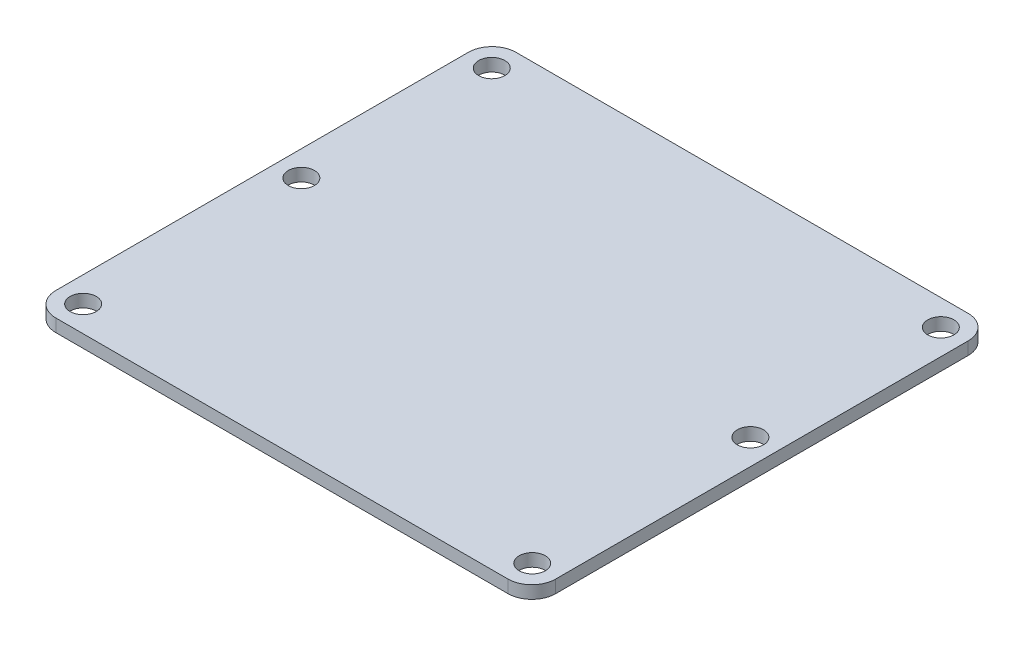
ISO-10303-21;
HEADER;
FILE_DESCRIPTION(('STEP AP214'),'2;1');
FILE_NAME('part.step','',(''),(''),'','','');
FILE_SCHEMA(('AUTOMOTIVE_DESIGN { 1 0 10303 214 1 1 1 1 }'));
ENDSEC;
DATA;
#1=APPLICATION_CONTEXT('core data for automotive mechanical design processes');
#2=APPLICATION_PROTOCOL_DEFINITION('international standard','automotive_design',2000,#1);
#3=PRODUCT_CONTEXT('',#1,'mechanical');
#4=PRODUCT('Part','Part','',(#3));
#5=PRODUCT_RELATED_PRODUCT_CATEGORY('part','',(#4));
#6=PRODUCT_DEFINITION_FORMATION('','',#4);
#7=PRODUCT_DEFINITION_CONTEXT('part definition',#1,'design');
#8=PRODUCT_DEFINITION('design','',#6,#7);
#9=PRODUCT_DEFINITION_SHAPE('','',#8);
#10=(LENGTH_UNIT() NAMED_UNIT(*) SI_UNIT(.MILLI.,.METRE.));
#11=(NAMED_UNIT(*) PLANE_ANGLE_UNIT() SI_UNIT($,.RADIAN.));
#12=(NAMED_UNIT(*) SI_UNIT($,.STERADIAN.) SOLID_ANGLE_UNIT());
#13=UNCERTAINTY_MEASURE_WITH_UNIT(LENGTH_MEASURE(1.E-05),#10,'distance_accuracy_value','');
#14=(GEOMETRIC_REPRESENTATION_CONTEXT(3) GLOBAL_UNCERTAINTY_ASSIGNED_CONTEXT((#13)) GLOBAL_UNIT_ASSIGNED_CONTEXT((#10,
#11,#12)) REPRESENTATION_CONTEXT('',''));
#15=CARTESIAN_POINT('',(0.,0.,0.));
#16=DIRECTION('',(0.,0.,1.));
#17=DIRECTION('',(1.,0.,0.));
#18=AXIS2_PLACEMENT_3D('',#15,#16,#17);
#19=CARTESIAN_POINT('',(31.5,1.6,-29.));
#20=DIRECTION('',(-1.,0.,0.));
#21=DIRECTION('',(0.,0.,1.));
#22=AXIS2_PLACEMENT_3D('',#19,#20,#21);
#23=PLANE('',#22);
#24=DIRECTION('',(0.,0.,-1.));
#25=VECTOR('',#24,1.);
#26=CARTESIAN_POINT('',(31.5,0.,-29.));
#27=LINE('',#26,#25);
#28=CARTESIAN_POINT('',(31.5,0.,26.));
#29=VERTEX_POINT('',#28);
#30=CARTESIAN_POINT('',(31.5,0.,-26.));
#31=VERTEX_POINT('',#30);
#32=EDGE_CURVE('E161',#29,#31,#27,.T.);
#33=ORIENTED_EDGE('',*,*,#32,.T.);
#34=DIRECTION('',(0.,-1.,0.));
#35=VECTOR('',#34,1.);
#36=CARTESIAN_POINT('',(31.5,1.6,-26.));
#37=LINE('',#36,#35);
#38=CARTESIAN_POINT('',(31.5,1.6,-26.));
#39=VERTEX_POINT('',#38);
#40=EDGE_CURVE('E11',#31,#39,#37,.F.);
#41=ORIENTED_EDGE('',*,*,#40,.T.);
#42=DIRECTION('',(0.,0.,-1.));
#43=VECTOR('',#42,1.);
#44=CARTESIAN_POINT('',(31.5,1.6,-29.));
#45=LINE('',#44,#43);
#46=CARTESIAN_POINT('',(31.5,1.6,26.));
#47=VERTEX_POINT('',#46);
#48=EDGE_CURVE('E129',#47,#39,#45,.T.);
#49=ORIENTED_EDGE('',*,*,#48,.F.);
#50=DIRECTION('',(0.,-1.,0.));
#51=VECTOR('',#50,1.);
#52=CARTESIAN_POINT('',(31.5,1.6,26.));
#53=LINE('',#52,#51);
#54=EDGE_CURVE('E45',#47,#29,#53,.T.);
#55=ORIENTED_EDGE('',*,*,#54,.T.);
#56=EDGE_LOOP('',(#33,#41,#49,#55));
#57=FACE_BOUND('',#56,.T.);
#58=ADVANCED_FACE('F37',(#57),#23,.F.);
#59=CARTESIAN_POINT('',(-31.5,1.6,-29.));
#60=DIRECTION('',(0.,0.,1.));
#61=DIRECTION('',(1.,0.,0.));
#62=AXIS2_PLACEMENT_3D('',#59,#60,#61);
#63=PLANE('',#62);
#64=DIRECTION('',(-1.,0.,0.));
#65=VECTOR('',#64,1.);
#66=CARTESIAN_POINT('',(-31.5,0.,-29.));
#67=LINE('',#66,#65);
#68=CARTESIAN_POINT('',(28.5,0.,-29.));
#69=VERTEX_POINT('',#68);
#70=CARTESIAN_POINT('',(-28.5,0.,-29.));
#71=VERTEX_POINT('',#70);
#72=EDGE_CURVE('E134',#69,#71,#67,.T.);
#73=ORIENTED_EDGE('',*,*,#72,.T.);
#74=DIRECTION('',(0.,-1.,0.));
#75=VECTOR('',#74,1.);
#76=CARTESIAN_POINT('',(-28.5,1.6,-29.));
#77=LINE('',#76,#75);
#78=CARTESIAN_POINT('',(-28.5,1.6,-29.));
#79=VERTEX_POINT('',#78);
#80=EDGE_CURVE('E52',#71,#79,#77,.F.);
#81=ORIENTED_EDGE('',*,*,#80,.T.);
#82=DIRECTION('',(-1.,0.,0.));
#83=VECTOR('',#82,1.);
#84=CARTESIAN_POINT('',(-31.5,1.6,-29.));
#85=LINE('',#84,#83);
#86=CARTESIAN_POINT('',(28.5,1.6,-29.));
#87=VERTEX_POINT('',#86);
#88=EDGE_CURVE('E132',#87,#79,#85,.T.);
#89=ORIENTED_EDGE('',*,*,#88,.F.);
#90=DIRECTION('',(0.,-1.,0.));
#91=VECTOR('',#90,1.);
#92=CARTESIAN_POINT('',(28.5,1.6,-29.));
#93=LINE('',#92,#91);
#94=EDGE_CURVE('E153',#87,#69,#93,.T.);
#95=ORIENTED_EDGE('',*,*,#94,.T.);
#96=EDGE_LOOP('',(#73,#81,#89,#95));
#97=FACE_BOUND('',#96,.T.);
#98=ADVANCED_FACE('F239',(#97),#63,.F.);
#99=CARTESIAN_POINT('',(-31.5,1.6,-29.));
#100=DIRECTION('',(1.,0.,0.));
#101=DIRECTION('',(0.,0.,-1.));
#102=AXIS2_PLACEMENT_3D('',#99,#100,#101);
#103=PLANE('',#102);
#104=DIRECTION('',(0.,0.,1.));
#105=VECTOR('',#104,1.);
#106=CARTESIAN_POINT('',(-31.5,0.,-29.));
#107=LINE('',#106,#105);
#108=CARTESIAN_POINT('',(-31.5,0.,-26.));
#109=VERTEX_POINT('',#108);
#110=CARTESIAN_POINT('',(-31.5,0.,26.));
#111=VERTEX_POINT('',#110);
#112=EDGE_CURVE('E130',#109,#111,#107,.T.);
#113=ORIENTED_EDGE('',*,*,#112,.T.);
#114=DIRECTION('',(0.,-1.,0.));
#115=VECTOR('',#114,1.);
#116=CARTESIAN_POINT('',(-31.5,1.6,26.));
#117=LINE('',#116,#115);
#118=CARTESIAN_POINT('',(-31.5,1.6,26.));
#119=VERTEX_POINT('',#118);
#120=EDGE_CURVE('E108',#111,#119,#117,.F.);
#121=ORIENTED_EDGE('',*,*,#120,.T.);
#122=DIRECTION('',(0.,0.,1.));
#123=VECTOR('',#122,1.);
#124=CARTESIAN_POINT('',(-31.5,1.6,-29.));
#125=LINE('',#124,#123);
#126=CARTESIAN_POINT('',(-31.5,1.6,-26.));
#127=VERTEX_POINT('',#126);
#128=EDGE_CURVE('E173',#127,#119,#125,.T.);
#129=ORIENTED_EDGE('',*,*,#128,.F.);
#130=DIRECTION('',(0.,-1.,0.));
#131=VECTOR('',#130,1.);
#132=CARTESIAN_POINT('',(-31.5,1.6,-26.));
#133=LINE('',#132,#131);
#134=EDGE_CURVE('E113',#127,#109,#133,.T.);
#135=ORIENTED_EDGE('',*,*,#134,.T.);
#136=EDGE_LOOP('',(#113,#121,#129,#135));
#137=FACE_BOUND('',#136,.T.);
#138=ADVANCED_FACE('F236',(#137),#103,.F.);
#139=CARTESIAN_POINT('',(-31.5,1.6,29.));
#140=DIRECTION('',(0.,0.,-1.));
#141=DIRECTION('',(-1.,0.,0.));
#142=AXIS2_PLACEMENT_3D('',#139,#140,#141);
#143=PLANE('',#142);
#144=DIRECTION('',(1.,0.,0.));
#145=VECTOR('',#144,1.);
#146=CARTESIAN_POINT('',(-31.5,1.6,29.));
#147=LINE('',#146,#145);
#148=CARTESIAN_POINT('',(-28.5,1.6,29.));
#149=VERTEX_POINT('',#148);
#150=CARTESIAN_POINT('',(28.5,1.6,29.));
#151=VERTEX_POINT('',#150);
#152=EDGE_CURVE('E123',#149,#151,#147,.T.);
#153=ORIENTED_EDGE('',*,*,#152,.F.);
#154=DIRECTION('',(0.,-1.,0.));
#155=VECTOR('',#154,1.);
#156=CARTESIAN_POINT('',(-28.5,1.6,29.));
#157=LINE('',#156,#155);
#158=CARTESIAN_POINT('',(-28.5,0.,29.));
#159=VERTEX_POINT('',#158);
#160=EDGE_CURVE('E107',#149,#159,#157,.T.);
#161=ORIENTED_EDGE('',*,*,#160,.T.);
#162=DIRECTION('',(1.,0.,0.));
#163=VECTOR('',#162,1.);
#164=CARTESIAN_POINT('',(-31.5,0.,29.));
#165=LINE('',#164,#163);
#166=CARTESIAN_POINT('',(28.5,0.,29.));
#167=VERTEX_POINT('',#166);
#168=EDGE_CURVE('E120',#159,#167,#165,.T.);
#169=ORIENTED_EDGE('',*,*,#168,.T.);
#170=DIRECTION('',(0.,-1.,0.));
#171=VECTOR('',#170,1.);
#172=CARTESIAN_POINT('',(28.5,1.6,29.));
#173=LINE('',#172,#171);
#174=EDGE_CURVE('E125',#167,#151,#173,.F.);
#175=ORIENTED_EDGE('',*,*,#174,.T.);
#176=EDGE_LOOP('',(#153,#161,#169,#175));
#177=FACE_BOUND('',#176,.T.);
#178=ADVANCED_FACE('F119',(#177),#143,.F.);
#179=CARTESIAN_POINT('',(0.,1.6,0.));
#180=DIRECTION('',(0.,1.,0.));
#181=DIRECTION('',(0.,0.,1.));
#182=AXIS2_PLACEMENT_3D('',#179,#180,#181);
#183=PLANE('',#182);
#184=CARTESIAN_POINT('',(-28.3,1.6,-1.75));
#185=DIRECTION('',(0.,1.,0.));
#186=DIRECTION('',(0.,0.,1.));
#187=AXIS2_PLACEMENT_3D('',#184,#185,#186);
#188=CIRCLE('',#187,1.65);
#189=CARTESIAN_POINT('',(-28.3,1.6,-0.0999999999999994));
#190=VERTEX_POINT('',#189);
#191=EDGE_CURVE('E204',#190,#190,#188,.T.);
#192=ORIENTED_EDGE('',*,*,#191,.F.);
#193=EDGE_LOOP('',(#192));
#194=FACE_BOUND('',#193,.T.);
#195=CARTESIAN_POINT('',(28.3,1.6,-1.75));
#196=DIRECTION('',(0.,1.,0.));
#197=DIRECTION('',(0.,0.,-1.));
#198=AXIS2_PLACEMENT_3D('',#195,#196,#197);
#199=CIRCLE('',#198,1.65);
#200=CARTESIAN_POINT('',(28.3,1.6,-3.4));
#201=VERTEX_POINT('',#200);
#202=EDGE_CURVE('E201',#201,#201,#199,.T.);
#203=ORIENTED_EDGE('',*,*,#202,.F.);
#204=EDGE_LOOP('',(#203));
#205=FACE_BOUND('',#204,.T.);
#206=CARTESIAN_POINT('',(-28.3,1.6,-25.75));
#207=DIRECTION('',(0.,1.,0.));
#208=DIRECTION('',(0.,0.,1.));
#209=AXIS2_PLACEMENT_3D('',#206,#207,#208);
#210=CIRCLE('',#209,1.65);
#211=CARTESIAN_POINT('',(-28.3,1.6,-24.1));
#212=VERTEX_POINT('',#211);
#213=EDGE_CURVE('E178',#212,#212,#210,.T.);
#214=ORIENTED_EDGE('',*,*,#213,.F.);
#215=EDGE_LOOP('',(#214));
#216=FACE_BOUND('',#215,.T.);
#217=CARTESIAN_POINT('',(28.3,1.6,25.75));
#218=DIRECTION('',(0.,1.,0.));
#219=DIRECTION('',(0.,0.,1.));
#220=AXIS2_PLACEMENT_3D('',#217,#218,#219);
#221=CIRCLE('',#220,1.65);
#222=CARTESIAN_POINT('',(28.3,1.6,27.4));
#223=VERTEX_POINT('',#222);
#224=EDGE_CURVE('E183',#223,#223,#221,.T.);
#225=ORIENTED_EDGE('',*,*,#224,.F.);
#226=EDGE_LOOP('',(#225));
#227=FACE_BOUND('',#226,.T.);
#228=CARTESIAN_POINT('',(-28.3,1.6,25.75));
#229=DIRECTION('',(0.,1.,0.));
#230=DIRECTION('',(0.,0.,1.));
#231=AXIS2_PLACEMENT_3D('',#228,#229,#230);
#232=CIRCLE('',#231,1.65);
#233=CARTESIAN_POINT('',(-28.3,1.6,27.4));
#234=VERTEX_POINT('',#233);
#235=EDGE_CURVE('E184',#234,#234,#232,.T.);
#236=ORIENTED_EDGE('',*,*,#235,.F.);
#237=EDGE_LOOP('',(#236));
#238=FACE_BOUND('',#237,.T.);
#239=CARTESIAN_POINT('',(28.3,1.6,-25.75));
#240=DIRECTION('',(0.,1.,0.));
#241=DIRECTION('',(0.,0.,1.));
#242=AXIS2_PLACEMENT_3D('',#239,#240,#241);
#243=CIRCLE('',#242,1.65);
#244=CARTESIAN_POINT('',(28.3,1.6,-24.1));
#245=VERTEX_POINT('',#244);
#246=EDGE_CURVE('E169',#245,#245,#243,.T.);
#247=ORIENTED_EDGE('',*,*,#246,.F.);
#248=EDGE_LOOP('',(#247));
#249=FACE_BOUND('',#248,.T.);
#250=ORIENTED_EDGE('',*,*,#128,.T.);
#251=CARTESIAN_POINT('',(-28.5,1.6,26.));
#252=DIRECTION('',(0.,1.,0.));
#253=DIRECTION('',(0.,0.,1.));
#254=AXIS2_PLACEMENT_3D('',#251,#252,#253);
#255=CIRCLE('',#254,3.);
#256=EDGE_CURVE('E151',#119,#149,#255,.T.);
#257=ORIENTED_EDGE('',*,*,#256,.T.);
#258=ORIENTED_EDGE('',*,*,#152,.T.);
#259=CARTESIAN_POINT('',(28.5,1.6,26.));
#260=DIRECTION('',(0.,1.,0.));
#261=DIRECTION('',(0.,0.,1.));
#262=AXIS2_PLACEMENT_3D('',#259,#260,#261);
#263=CIRCLE('',#262,3.);
#264=EDGE_CURVE('E146',#151,#47,#263,.T.);
#265=ORIENTED_EDGE('',*,*,#264,.T.);
#266=ORIENTED_EDGE('',*,*,#48,.T.);
#267=CARTESIAN_POINT('',(28.5,1.6,-26.));
#268=DIRECTION('',(0.,1.,0.));
#269=DIRECTION('',(0.,0.,1.));
#270=AXIS2_PLACEMENT_3D('',#267,#268,#269);
#271=CIRCLE('',#270,3.);
#272=EDGE_CURVE('E59',#39,#87,#271,.T.);
#273=ORIENTED_EDGE('',*,*,#272,.T.);
#274=ORIENTED_EDGE('',*,*,#88,.T.);
#275=CARTESIAN_POINT('',(-28.5,1.6,-26.));
#276=DIRECTION('',(0.,1.,0.));
#277=DIRECTION('',(0.,0.,1.));
#278=AXIS2_PLACEMENT_3D('',#275,#276,#277);
#279=CIRCLE('',#278,3.);
#280=EDGE_CURVE('E149',#79,#127,#279,.T.);
#281=ORIENTED_EDGE('',*,*,#280,.T.);
#282=EDGE_LOOP('',(#250,#257,#258,#265,#266,#273,#274,#281));
#283=FACE_BOUND('',#282,.T.);
#284=ADVANCED_FACE('F219',(#194,#205,#216,#227,#238,#249,#283),#183,.T.);
#285=CARTESIAN_POINT('',(0.,0.,0.));
#286=DIRECTION('',(0.,1.,0.));
#287=DIRECTION('',(0.,0.,1.));
#288=AXIS2_PLACEMENT_3D('',#285,#286,#287);
#289=PLANE('',#288);
#290=CARTESIAN_POINT('',(-28.3,0.,-1.75));
#291=DIRECTION('',(0.,1.,0.));
#292=DIRECTION('',(0.,0.,1.));
#293=AXIS2_PLACEMENT_3D('',#290,#291,#292);
#294=CIRCLE('',#293,1.65);
#295=CARTESIAN_POINT('',(-28.3,0.,-0.0999999999999994));
#296=VERTEX_POINT('',#295);
#297=EDGE_CURVE('E195',#296,#296,#294,.T.);
#298=ORIENTED_EDGE('',*,*,#297,.T.);
#299=EDGE_LOOP('',(#298));
#300=FACE_BOUND('',#299,.T.);
#301=CARTESIAN_POINT('',(28.3,0.,-1.75));
#302=DIRECTION('',(0.,1.,0.));
#303=DIRECTION('',(0.,0.,-1.));
#304=AXIS2_PLACEMENT_3D('',#301,#302,#303);
#305=CIRCLE('',#304,1.65);
#306=CARTESIAN_POINT('',(28.3,0.,-3.4));
#307=VERTEX_POINT('',#306);
#308=EDGE_CURVE('E198',#307,#307,#305,.T.);
#309=ORIENTED_EDGE('',*,*,#308,.T.);
#310=EDGE_LOOP('',(#309));
#311=FACE_BOUND('',#310,.T.);
#312=CARTESIAN_POINT('',(-28.3,0.,-25.75));
#313=DIRECTION('',(0.,1.,0.));
#314=DIRECTION('',(0.,0.,1.));
#315=AXIS2_PLACEMENT_3D('',#312,#313,#314);
#316=CIRCLE('',#315,1.65);
#317=CARTESIAN_POINT('',(-28.3,0.,-24.1));
#318=VERTEX_POINT('',#317);
#319=EDGE_CURVE('E187',#318,#318,#316,.T.);
#320=ORIENTED_EDGE('',*,*,#319,.T.);
#321=EDGE_LOOP('',(#320));
#322=FACE_BOUND('',#321,.T.);
#323=CARTESIAN_POINT('',(28.3,0.,25.75));
#324=DIRECTION('',(0.,1.,0.));
#325=DIRECTION('',(0.,0.,1.));
#326=AXIS2_PLACEMENT_3D('',#323,#324,#325);
#327=CIRCLE('',#326,1.65);
#328=CARTESIAN_POINT('',(28.3,0.,27.4));
#329=VERTEX_POINT('',#328);
#330=EDGE_CURVE('E180',#329,#329,#327,.T.);
#331=ORIENTED_EDGE('',*,*,#330,.T.);
#332=EDGE_LOOP('',(#331));
#333=FACE_BOUND('',#332,.T.);
#334=CARTESIAN_POINT('',(-28.3,0.,25.75));
#335=DIRECTION('',(0.,1.,0.));
#336=DIRECTION('',(0.,0.,1.));
#337=AXIS2_PLACEMENT_3D('',#334,#335,#336);
#338=CIRCLE('',#337,1.65);
#339=CARTESIAN_POINT('',(-28.3,0.,27.4));
#340=VERTEX_POINT('',#339);
#341=EDGE_CURVE('E192',#340,#340,#338,.T.);
#342=ORIENTED_EDGE('',*,*,#341,.T.);
#343=EDGE_LOOP('',(#342));
#344=FACE_BOUND('',#343,.T.);
#345=CARTESIAN_POINT('',(28.3,0.,-25.75));
#346=DIRECTION('',(0.,1.,0.));
#347=DIRECTION('',(0.,0.,1.));
#348=AXIS2_PLACEMENT_3D('',#345,#346,#347);
#349=CIRCLE('',#348,1.65);
#350=CARTESIAN_POINT('',(28.3,0.,-24.1));
#351=VERTEX_POINT('',#350);
#352=EDGE_CURVE('E166',#351,#351,#349,.T.);
#353=ORIENTED_EDGE('',*,*,#352,.T.);
#354=EDGE_LOOP('',(#353));
#355=FACE_BOUND('',#354,.T.);
#356=ORIENTED_EDGE('',*,*,#168,.F.);
#357=CARTESIAN_POINT('',(-28.5,0.,26.));
#358=DIRECTION('',(0.,1.,0.));
#359=DIRECTION('',(0.,0.,1.));
#360=AXIS2_PLACEMENT_3D('',#357,#358,#359);
#361=CIRCLE('',#360,3.);
#362=EDGE_CURVE('E103',#159,#111,#361,.F.);
#363=ORIENTED_EDGE('',*,*,#362,.T.);
#364=ORIENTED_EDGE('',*,*,#112,.F.);
#365=CARTESIAN_POINT('',(-28.5,0.,-26.));
#366=DIRECTION('',(0.,1.,0.));
#367=DIRECTION('',(0.,0.,1.));
#368=AXIS2_PLACEMENT_3D('',#365,#366,#367);
#369=CIRCLE('',#368,3.);
#370=EDGE_CURVE('E114',#109,#71,#369,.F.);
#371=ORIENTED_EDGE('',*,*,#370,.T.);
#372=ORIENTED_EDGE('',*,*,#72,.F.);
#373=CARTESIAN_POINT('',(28.5,0.,-26.));
#374=DIRECTION('',(0.,1.,0.));
#375=DIRECTION('',(0.,0.,1.));
#376=AXIS2_PLACEMENT_3D('',#373,#374,#375);
#377=CIRCLE('',#376,3.);
#378=EDGE_CURVE('E140',#69,#31,#377,.F.);
#379=ORIENTED_EDGE('',*,*,#378,.T.);
#380=ORIENTED_EDGE('',*,*,#32,.F.);
#381=CARTESIAN_POINT('',(28.5,0.,26.));
#382=DIRECTION('',(0.,1.,0.));
#383=DIRECTION('',(0.,0.,1.));
#384=AXIS2_PLACEMENT_3D('',#381,#382,#383);
#385=CIRCLE('',#384,3.);
#386=EDGE_CURVE('E124',#29,#167,#385,.F.);
#387=ORIENTED_EDGE('',*,*,#386,.T.);
#388=EDGE_LOOP('',(#356,#363,#364,#371,#372,#379,#380,#387));
#389=FACE_BOUND('',#388,.T.);
#390=ADVANCED_FACE('F127',(#300,#311,#322,#333,#344,#355,#389),#289,.F.);
#391=CARTESIAN_POINT('',(28.3,0.,-25.75));
#392=DIRECTION('',(0.,1.,0.));
#393=DIRECTION('',(0.,0.,1.));
#394=AXIS2_PLACEMENT_3D('',#391,#392,#393);
#395=CYLINDRICAL_SURFACE('',#394,1.65);
#396=ORIENTED_EDGE('',*,*,#352,.F.);
#397=EDGE_LOOP('',(#396));
#398=FACE_BOUND('',#397,.T.);
#399=ORIENTED_EDGE('',*,*,#246,.T.);
#400=EDGE_LOOP('',(#399));
#401=FACE_BOUND('',#400,.T.);
#402=ADVANCED_FACE('F296',(#398,#401),#395,.F.);
#403=CARTESIAN_POINT('',(-28.3,0.,25.75));
#404=DIRECTION('',(0.,1.,0.));
#405=DIRECTION('',(0.,0.,1.));
#406=AXIS2_PLACEMENT_3D('',#403,#404,#405);
#407=CYLINDRICAL_SURFACE('',#406,1.65);
#408=ORIENTED_EDGE('',*,*,#341,.F.);
#409=EDGE_LOOP('',(#408));
#410=FACE_BOUND('',#409,.T.);
#411=ORIENTED_EDGE('',*,*,#235,.T.);
#412=EDGE_LOOP('',(#411));
#413=FACE_BOUND('',#412,.T.);
#414=ADVANCED_FACE('F343',(#410,#413),#407,.F.);
#415=CARTESIAN_POINT('',(28.3,0.,25.75));
#416=DIRECTION('',(0.,1.,0.));
#417=DIRECTION('',(0.,0.,1.));
#418=AXIS2_PLACEMENT_3D('',#415,#416,#417);
#419=CYLINDRICAL_SURFACE('',#418,1.65);
#420=ORIENTED_EDGE('',*,*,#330,.F.);
#421=EDGE_LOOP('',(#420));
#422=FACE_BOUND('',#421,.T.);
#423=ORIENTED_EDGE('',*,*,#224,.T.);
#424=EDGE_LOOP('',(#423));
#425=FACE_BOUND('',#424,.T.);
#426=ADVANCED_FACE('F333',(#422,#425),#419,.F.);
#427=CARTESIAN_POINT('',(-28.3,0.,-25.75));
#428=DIRECTION('',(0.,1.,0.));
#429=DIRECTION('',(0.,0.,1.));
#430=AXIS2_PLACEMENT_3D('',#427,#428,#429);
#431=CYLINDRICAL_SURFACE('',#430,1.65);
#432=ORIENTED_EDGE('',*,*,#319,.F.);
#433=EDGE_LOOP('',(#432));
#434=FACE_BOUND('',#433,.T.);
#435=ORIENTED_EDGE('',*,*,#213,.T.);
#436=EDGE_LOOP('',(#435));
#437=FACE_BOUND('',#436,.T.);
#438=ADVANCED_FACE('F260',(#434,#437),#431,.F.);
#439=CARTESIAN_POINT('',(-28.5,1.6,26.));
#440=DIRECTION('',(0.,-1.,0.));
#441=DIRECTION('',(0.,0.,-1.));
#442=AXIS2_PLACEMENT_3D('',#439,#440,#441);
#443=CYLINDRICAL_SURFACE('',#442,3.);
#444=ORIENTED_EDGE('',*,*,#256,.F.);
#445=ORIENTED_EDGE('',*,*,#120,.F.);
#446=ORIENTED_EDGE('',*,*,#362,.F.);
#447=ORIENTED_EDGE('',*,*,#160,.F.);
#448=EDGE_LOOP('',(#444,#445,#446,#447));
#449=FACE_BOUND('',#448,.T.);
#450=ADVANCED_FACE('F106',(#449),#443,.T.);
#451=CARTESIAN_POINT('',(-28.5,1.6,-26.));
#452=DIRECTION('',(0.,-1.,0.));
#453=DIRECTION('',(0.,0.,-1.));
#454=AXIS2_PLACEMENT_3D('',#451,#452,#453);
#455=CYLINDRICAL_SURFACE('',#454,3.);
#456=ORIENTED_EDGE('',*,*,#280,.F.);
#457=ORIENTED_EDGE('',*,*,#80,.F.);
#458=ORIENTED_EDGE('',*,*,#370,.F.);
#459=ORIENTED_EDGE('',*,*,#134,.F.);
#460=EDGE_LOOP('',(#456,#457,#458,#459));
#461=FACE_BOUND('',#460,.T.);
#462=ADVANCED_FACE('F238',(#461),#455,.T.);
#463=CARTESIAN_POINT('',(28.5,1.6,-26.));
#464=DIRECTION('',(0.,-1.,0.));
#465=DIRECTION('',(0.,0.,-1.));
#466=AXIS2_PLACEMENT_3D('',#463,#464,#465);
#467=CYLINDRICAL_SURFACE('',#466,3.);
#468=ORIENTED_EDGE('',*,*,#272,.F.);
#469=ORIENTED_EDGE('',*,*,#40,.F.);
#470=ORIENTED_EDGE('',*,*,#378,.F.);
#471=ORIENTED_EDGE('',*,*,#94,.F.);
#472=EDGE_LOOP('',(#468,#469,#470,#471));
#473=FACE_BOUND('',#472,.T.);
#474=ADVANCED_FACE('F242',(#473),#467,.T.);
#475=CARTESIAN_POINT('',(28.5,1.6,26.));
#476=DIRECTION('',(0.,-1.,0.));
#477=DIRECTION('',(0.,0.,-1.));
#478=AXIS2_PLACEMENT_3D('',#475,#476,#477);
#479=CYLINDRICAL_SURFACE('',#478,3.);
#480=ORIENTED_EDGE('',*,*,#264,.F.);
#481=ORIENTED_EDGE('',*,*,#174,.F.);
#482=ORIENTED_EDGE('',*,*,#386,.F.);
#483=ORIENTED_EDGE('',*,*,#54,.F.);
#484=EDGE_LOOP('',(#480,#481,#482,#483));
#485=FACE_BOUND('',#484,.T.);
#486=ADVANCED_FACE('F39',(#485),#479,.T.);
#487=CARTESIAN_POINT('',(28.3,0.,-1.75));
#488=DIRECTION('',(0.,1.,0.));
#489=DIRECTION('',(0.,0.,1.));
#490=AXIS2_PLACEMENT_3D('',#487,#488,#489);
#491=CYLINDRICAL_SURFACE('',#490,1.65);
#492=ORIENTED_EDGE('',*,*,#308,.F.);
#493=EDGE_LOOP('',(#492));
#494=FACE_BOUND('',#493,.T.);
#495=ORIENTED_EDGE('',*,*,#202,.T.);
#496=EDGE_LOOP('',(#495));
#497=FACE_BOUND('',#496,.T.);
#498=ADVANCED_FACE('F215',(#494,#497),#491,.F.);
#499=CARTESIAN_POINT('',(-28.3,0.,-1.75));
#500=DIRECTION('',(0.,1.,0.));
#501=DIRECTION('',(0.,0.,1.));
#502=AXIS2_PLACEMENT_3D('',#499,#500,#501);
#503=CYLINDRICAL_SURFACE('',#502,1.65);
#504=ORIENTED_EDGE('',*,*,#297,.F.);
#505=EDGE_LOOP('',(#504));
#506=FACE_BOUND('',#505,.T.);
#507=ORIENTED_EDGE('',*,*,#191,.T.);
#508=EDGE_LOOP('',(#507));
#509=FACE_BOUND('',#508,.T.);
#510=ADVANCED_FACE('F212',(#506,#509),#503,.F.);
#511=CLOSED_SHELL('',(#58,#98,#138,#178,#284,#390,#402,#414,#426,#438,#450,#462,#474,#486,#498,#510));
#512=MANIFOLD_SOLID_BREP('B2',#511);
#513=ADVANCED_BREP_SHAPE_REPRESENTATION('',(#18,#512),#14);
#514=SHAPE_DEFINITION_REPRESENTATION(#9,#513);
ENDSEC;
END-ISO-10303-21;
